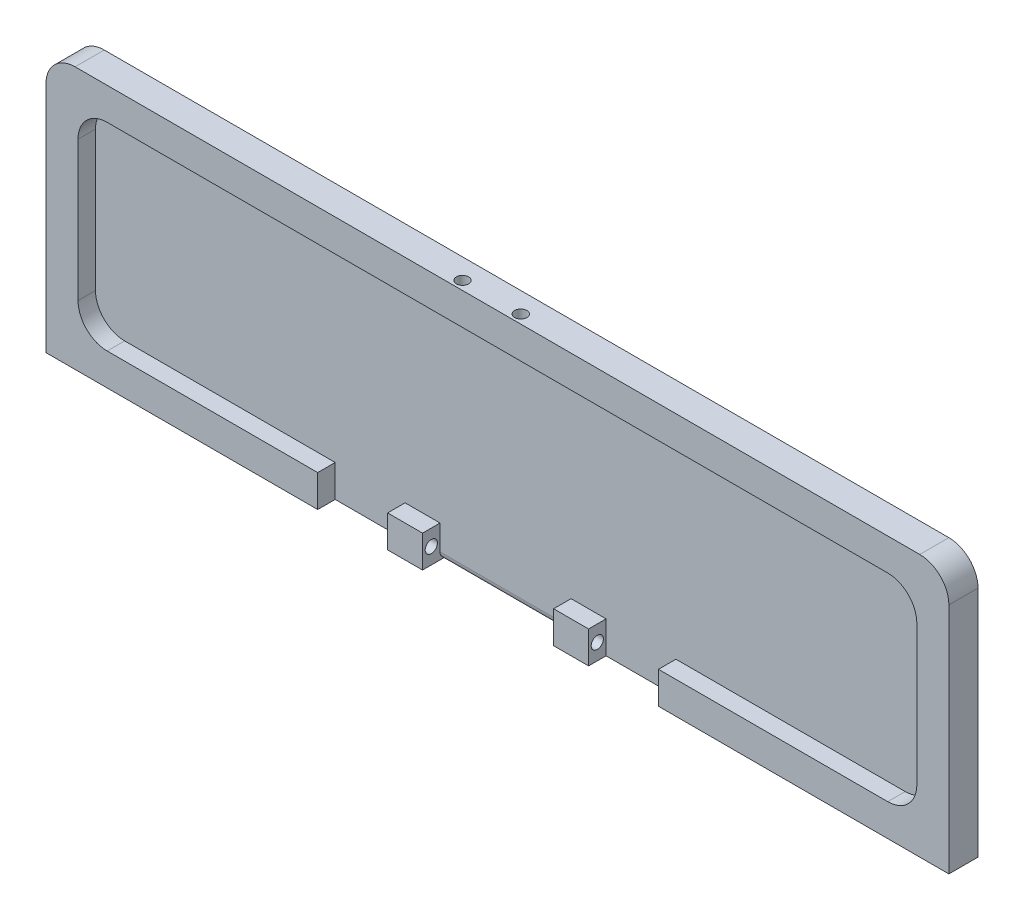
ISO-10303-21;
HEADER;
FILE_DESCRIPTION(('STEP AP214'),'2;1');
FILE_NAME('part.step','',(''),(''),'','','');
FILE_SCHEMA(('AUTOMOTIVE_DESIGN { 1 0 10303 214 1 1 1 1 }'));
ENDSEC;
DATA;
#1=APPLICATION_CONTEXT('core data for automotive mechanical design processes');
#2=APPLICATION_PROTOCOL_DEFINITION('international standard','automotive_design',2000,#1);
#3=PRODUCT_CONTEXT('',#1,'mechanical');
#4=PRODUCT('Part','Part','',(#3));
#5=PRODUCT_RELATED_PRODUCT_CATEGORY('part','',(#4));
#6=PRODUCT_DEFINITION_FORMATION('','',#4);
#7=PRODUCT_DEFINITION_CONTEXT('part definition',#1,'design');
#8=PRODUCT_DEFINITION('design','',#6,#7);
#9=PRODUCT_DEFINITION_SHAPE('','',#8);
#10=(LENGTH_UNIT() NAMED_UNIT(*) SI_UNIT(.MILLI.,.METRE.));
#11=(NAMED_UNIT(*) PLANE_ANGLE_UNIT() SI_UNIT($,.RADIAN.));
#12=(NAMED_UNIT(*) SI_UNIT($,.STERADIAN.) SOLID_ANGLE_UNIT());
#13=UNCERTAINTY_MEASURE_WITH_UNIT(LENGTH_MEASURE(1.E-05),#10,'distance_accuracy_value','');
#14=(GEOMETRIC_REPRESENTATION_CONTEXT(3) GLOBAL_UNCERTAINTY_ASSIGNED_CONTEXT((#13)) GLOBAL_UNIT_ASSIGNED_CONTEXT((#10,
#11,#12)) REPRESENTATION_CONTEXT('',''));
#15=CARTESIAN_POINT('',(0.,0.,0.));
#16=DIRECTION('',(0.,0.,1.));
#17=DIRECTION('',(1.,0.,0.));
#18=AXIS2_PLACEMENT_3D('',#15,#16,#17);
#19=CARTESIAN_POINT('',(0.,0.,5.));
#20=DIRECTION('',(0.,0.,1.));
#21=DIRECTION('',(1.,0.,0.));
#22=AXIS2_PLACEMENT_3D('',#19,#20,#21);
#23=PLANE('',#22);
#24=DIRECTION('',(0.,-1.,0.));
#25=VECTOR('',#24,1.);
#26=CARTESIAN_POINT('',(-30.8542724171356,-17.,5.));
#27=LINE('',#26,#25);
#28=CARTESIAN_POINT('',(-30.8542724171356,-17.,5.));
#29=VERTEX_POINT('',#28);
#30=CARTESIAN_POINT('',(-30.8542724171356,-22.5,5.));
#31=VERTEX_POINT('',#30);
#32=EDGE_CURVE('E233',#29,#31,#27,.T.);
#33=ORIENTED_EDGE('',*,*,#32,.F.);
#34=DIRECTION('',(1.,0.,0.));
#35=VECTOR('',#34,1.);
#36=CARTESIAN_POINT('',(72.,-17.,5.));
#37=LINE('',#36,#35);
#38=CARTESIAN_POINT('',(-67.,-17.,5.));
#39=VERTEX_POINT('',#38);
#40=EDGE_CURVE('E291',#39,#29,#37,.T.);
#41=ORIENTED_EDGE('',*,*,#40,.F.);
#42=CARTESIAN_POINT('',(-67.,-12.,5.));
#43=DIRECTION('',(0.,0.,1.));
#44=DIRECTION('',(1.,0.,0.));
#45=AXIS2_PLACEMENT_3D('',#42,#43,#44);
#46=CIRCLE('',#45,5.);
#47=CARTESIAN_POINT('',(-72.,-12.,5.));
#48=VERTEX_POINT('',#47);
#49=EDGE_CURVE('E461',#39,#48,#46,.F.);
#50=ORIENTED_EDGE('',*,*,#49,.T.);
#51=DIRECTION('',(0.,-1.,0.));
#52=VECTOR('',#51,1.);
#53=CARTESIAN_POINT('',(-72.,-17.,5.));
#54=LINE('',#53,#52);
#55=CARTESIAN_POINT('',(-72.,12.,5.));
#56=VERTEX_POINT('',#55);
#57=EDGE_CURVE('E296',#56,#48,#54,.T.);
#58=ORIENTED_EDGE('',*,*,#57,.F.);
#59=CARTESIAN_POINT('',(-67.,12.,5.));
#60=DIRECTION('',(0.,0.,1.));
#61=DIRECTION('',(1.,0.,0.));
#62=AXIS2_PLACEMENT_3D('',#59,#60,#61);
#63=CIRCLE('',#62,5.);
#64=CARTESIAN_POINT('',(-67.,17.,5.));
#65=VERTEX_POINT('',#64);
#66=EDGE_CURVE('E458',#56,#65,#63,.F.);
#67=ORIENTED_EDGE('',*,*,#66,.T.);
#68=DIRECTION('',(-1.,0.,0.));
#69=VECTOR('',#68,1.);
#70=CARTESIAN_POINT('',(72.,17.,5.));
#71=LINE('',#70,#69);
#72=CARTESIAN_POINT('',(67.,17.,5.));
#73=VERTEX_POINT('',#72);
#74=EDGE_CURVE('E282',#73,#65,#71,.T.);
#75=ORIENTED_EDGE('',*,*,#74,.F.);
#76=CARTESIAN_POINT('',(67.,12.,5.));
#77=DIRECTION('',(0.,0.,1.));
#78=DIRECTION('',(1.,0.,0.));
#79=AXIS2_PLACEMENT_3D('',#76,#77,#78);
#80=CIRCLE('',#79,5.);
#81=CARTESIAN_POINT('',(72.,12.,5.));
#82=VERTEX_POINT('',#81);
#83=EDGE_CURVE('E466',#73,#82,#80,.F.);
#84=ORIENTED_EDGE('',*,*,#83,.T.);
#85=DIRECTION('',(0.,1.,0.));
#86=VECTOR('',#85,1.);
#87=CARTESIAN_POINT('',(72.,-17.,5.));
#88=LINE('',#87,#86);
#89=CARTESIAN_POINT('',(72.,-12.,5.));
#90=VERTEX_POINT('',#89);
#91=EDGE_CURVE('E287',#90,#82,#88,.T.);
#92=ORIENTED_EDGE('',*,*,#91,.F.);
#93=CARTESIAN_POINT('',(67.,-12.,5.));
#94=DIRECTION('',(0.,0.,1.));
#95=DIRECTION('',(1.,0.,0.));
#96=AXIS2_PLACEMENT_3D('',#93,#94,#95);
#97=CIRCLE('',#96,5.);
#98=CARTESIAN_POINT('',(67.,-17.,5.));
#99=VERTEX_POINT('',#98);
#100=EDGE_CURVE('E463',#90,#99,#97,.F.);
#101=ORIENTED_EDGE('',*,*,#100,.T.);
#102=CARTESIAN_POINT('',(27.6457275828644,-17.,5.));
#103=VERTEX_POINT('',#102);
#104=EDGE_CURVE('E300',#103,#99,#37,.T.);
#105=ORIENTED_EDGE('',*,*,#104,.F.);
#106=DIRECTION('',(0.,1.,0.));
#107=VECTOR('',#106,1.);
#108=CARTESIAN_POINT('',(27.6457275828644,-17.,5.));
#109=LINE('',#108,#107);
#110=CARTESIAN_POINT('',(27.6457275828644,-22.5,5.));
#111=VERTEX_POINT('',#110);
#112=EDGE_CURVE('E364',#111,#103,#109,.T.);
#113=ORIENTED_EDGE('',*,*,#112,.F.);
#114=DIRECTION('',(1.,0.,0.));
#115=VECTOR('',#114,1.);
#116=CARTESIAN_POINT('',(77.5,-22.5,5.));
#117=LINE('',#116,#115);
#118=CARTESIAN_POINT('',(77.5,-22.5,5.));
#119=VERTEX_POINT('',#118);
#120=EDGE_CURVE('E252',#111,#119,#117,.T.);
#121=ORIENTED_EDGE('',*,*,#120,.T.);
#122=DIRECTION('',(0.,1.,0.));
#123=VECTOR('',#122,1.);
#124=CARTESIAN_POINT('',(77.5,-22.5,5.));
#125=LINE('',#124,#123);
#126=CARTESIAN_POINT('',(77.5,17.5,5.));
#127=VERTEX_POINT('',#126);
#128=EDGE_CURVE('E257',#119,#127,#125,.T.);
#129=ORIENTED_EDGE('',*,*,#128,.T.);
#130=CARTESIAN_POINT('',(72.5,17.5,5.));
#131=DIRECTION('',(0.,0.,1.));
#132=DIRECTION('',(1.,0.,0.));
#133=AXIS2_PLACEMENT_3D('',#130,#131,#132);
#134=CIRCLE('',#133,5.);
#135=CARTESIAN_POINT('',(72.5,22.5,5.));
#136=VERTEX_POINT('',#135);
#137=EDGE_CURVE('E592',#127,#136,#134,.T.);
#138=ORIENTED_EDGE('',*,*,#137,.T.);
#139=DIRECTION('',(-1.,0.,0.));
#140=VECTOR('',#139,1.);
#141=CARTESIAN_POINT('',(77.5,22.5,5.));
#142=LINE('',#141,#140);
#143=CARTESIAN_POINT('',(-72.5,22.5,5.));
#144=VERTEX_POINT('',#143);
#145=EDGE_CURVE('E619',#136,#144,#142,.T.);
#146=ORIENTED_EDGE('',*,*,#145,.T.);
#147=CARTESIAN_POINT('',(-72.5,17.5,5.));
#148=DIRECTION('',(0.,0.,1.));
#149=DIRECTION('',(1.,0.,0.));
#150=AXIS2_PLACEMENT_3D('',#147,#148,#149);
#151=CIRCLE('',#150,5.);
#152=CARTESIAN_POINT('',(-77.5,17.5,5.));
#153=VERTEX_POINT('',#152);
#154=EDGE_CURVE('E595',#144,#153,#151,.T.);
#155=ORIENTED_EDGE('',*,*,#154,.T.);
#156=DIRECTION('',(0.,-1.,0.));
#157=VECTOR('',#156,1.);
#158=CARTESIAN_POINT('',(-77.5,-22.5,5.));
#159=LINE('',#158,#157);
#160=CARTESIAN_POINT('',(-77.5,-22.5,5.));
#161=VERTEX_POINT('',#160);
#162=EDGE_CURVE('E263',#153,#161,#159,.T.);
#163=ORIENTED_EDGE('',*,*,#162,.T.);
#164=EDGE_CURVE('E249',#161,#31,#117,.T.);
#165=ORIENTED_EDGE('',*,*,#164,.T.);
#166=EDGE_LOOP('',(#33,#41,#50,#58,#67,#75,#84,#92,#101,#105,#113,#121,#129,#138,#146,#155,#163,#165));
#167=FACE_BOUND('',#166,.T.);
#168=ADVANCED_FACE('F43',(#167),#23,.T.);
#169=CARTESIAN_POINT('',(72.,-17.,2.));
#170=DIRECTION('',(0.,-1.,0.));
#171=DIRECTION('',(0.,0.,-1.));
#172=AXIS2_PLACEMENT_3D('',#169,#170,#171);
#173=PLANE('',#172);
#174=ORIENTED_EDGE('',*,*,#40,.T.);
#175=DIRECTION('',(0.,0.,1.));
#176=VECTOR('',#175,1.);
#177=CARTESIAN_POINT('',(-30.8542724171356,-17.,-11.2003787824441));
#178=LINE('',#177,#176);
#179=CARTESIAN_POINT('',(-30.8542724171356,-17.,2.));
#180=VERTEX_POINT('',#179);
#181=EDGE_CURVE('E401',#180,#29,#178,.T.);
#182=ORIENTED_EDGE('',*,*,#181,.F.);
#183=DIRECTION('',(1.,0.,0.));
#184=VECTOR('',#183,1.);
#185=CARTESIAN_POINT('',(72.,-17.,2.));
#186=LINE('',#185,#184);
#187=CARTESIAN_POINT('',(-67.,-17.,2.));
#188=VERTEX_POINT('',#187);
#189=EDGE_CURVE('E311',#188,#180,#186,.T.);
#190=ORIENTED_EDGE('',*,*,#189,.F.);
#191=DIRECTION('',(0.,0.,1.));
#192=VECTOR('',#191,1.);
#193=CARTESIAN_POINT('',(-67.,-17.,5.));
#194=LINE('',#193,#192);
#195=EDGE_CURVE('E448',#188,#39,#194,.T.);
#196=ORIENTED_EDGE('',*,*,#195,.T.);
#197=EDGE_LOOP('',(#174,#182,#190,#196));
#198=FACE_BOUND('',#197,.T.);
#199=ADVANCED_FACE('F422',(#198),#173,.F.);
#200=CARTESIAN_POINT('',(9.64572758286437,-17.,5.));
#201=VERTEX_POINT('',#200);
#202=CARTESIAN_POINT('',(15.6457275828644,-17.,5.));
#203=VERTEX_POINT('',#202);
#204=EDGE_CURVE('E295',#201,#203,#37,.T.);
#205=ORIENTED_EDGE('',*,*,#204,.T.);
#206=DIRECTION('',(0.,0.,1.));
#207=VECTOR('',#206,1.);
#208=CARTESIAN_POINT('',(15.6457275828644,-17.,2.));
#209=LINE('',#208,#207);
#210=CARTESIAN_POINT('',(15.6457275828644,-17.,2.));
#211=VERTEX_POINT('',#210);
#212=EDGE_CURVE('E355',#211,#203,#209,.T.);
#213=ORIENTED_EDGE('',*,*,#212,.F.);
#214=CARTESIAN_POINT('',(9.64572758286437,-17.,2.));
#215=VERTEX_POINT('',#214);
#216=EDGE_CURVE('E316',#215,#211,#186,.T.);
#217=ORIENTED_EDGE('',*,*,#216,.F.);
#218=DIRECTION('',(0.,0.,1.));
#219=VECTOR('',#218,1.);
#220=CARTESIAN_POINT('',(9.64572758286437,-17.,2.));
#221=LINE('',#220,#219);
#222=EDGE_CURVE('E301',#215,#201,#221,.T.);
#223=ORIENTED_EDGE('',*,*,#222,.T.);
#224=EDGE_LOOP('',(#205,#213,#217,#223));
#225=FACE_BOUND('',#224,.T.);
#226=ADVANCED_FACE('F508',(#225),#173,.F.);
#227=DIRECTION('',(0.,-1.,0.));
#228=VECTOR('',#227,1.);
#229=CARTESIAN_POINT('',(15.6457275828644,-22.5,5.));
#230=LINE('',#229,#228);
#231=CARTESIAN_POINT('',(15.6457275828644,-22.5,5.));
#232=VERTEX_POINT('',#231);
#233=EDGE_CURVE('E361',#203,#232,#230,.T.);
#234=ORIENTED_EDGE('',*,*,#233,.F.);
#235=ORIENTED_EDGE('',*,*,#204,.F.);
#236=DIRECTION('',(0.,1.,0.));
#237=VECTOR('',#236,1.);
#238=CARTESIAN_POINT('',(9.64572758286437,-17.,5.));
#239=LINE('',#238,#237);
#240=CARTESIAN_POINT('',(9.64572758286438,-22.5,5.));
#241=VERTEX_POINT('',#240);
#242=EDGE_CURVE('E334',#241,#201,#239,.T.);
#243=ORIENTED_EDGE('',*,*,#242,.F.);
#244=EDGE_CURVE('E250',#241,#232,#117,.T.);
#245=ORIENTED_EDGE('',*,*,#244,.T.);
#246=EDGE_LOOP('',(#234,#235,#243,#245));
#247=FACE_BOUND('',#246,.T.);
#248=ADVANCED_FACE('F504',(#247),#23,.T.);
#249=CARTESIAN_POINT('',(27.6457275828644,-17.,2.));
#250=VERTEX_POINT('',#249);
#251=CARTESIAN_POINT('',(67.,-17.,2.));
#252=VERTEX_POINT('',#251);
#253=EDGE_CURVE('E320',#250,#252,#186,.T.);
#254=ORIENTED_EDGE('',*,*,#253,.F.);
#255=DIRECTION('',(0.,0.,1.));
#256=VECTOR('',#255,1.);
#257=CARTESIAN_POINT('',(27.6457275828644,-17.,2.));
#258=LINE('',#257,#256);
#259=EDGE_CURVE('E350',#250,#103,#258,.T.);
#260=ORIENTED_EDGE('',*,*,#259,.T.);
#261=ORIENTED_EDGE('',*,*,#104,.T.);
#262=DIRECTION('',(0.,0.,1.));
#263=VECTOR('',#262,1.);
#264=CARTESIAN_POINT('',(67.,-17.,2.));
#265=LINE('',#264,#263);
#266=EDGE_CURVE('E438',#99,#252,#265,.F.);
#267=ORIENTED_EDGE('',*,*,#266,.T.);
#268=EDGE_LOOP('',(#254,#260,#261,#267));
#269=FACE_BOUND('',#268,.T.);
#270=ADVANCED_FACE('F514',(#269),#173,.F.);
#271=CARTESIAN_POINT('',(-77.5,-22.5,5.));
#272=DIRECTION('',(1.,0.,0.));
#273=DIRECTION('',(0.,0.,-1.));
#274=AXIS2_PLACEMENT_3D('',#271,#272,#273);
#275=PLANE('',#274);
#276=ORIENTED_EDGE('',*,*,#162,.F.);
#277=DIRECTION('',(0.,0.,-1.));
#278=VECTOR('',#277,1.);
#279=CARTESIAN_POINT('',(-77.5,17.5,5.));
#280=LINE('',#279,#278);
#281=CARTESIAN_POINT('',(-77.5,17.5,0.));
#282=VERTEX_POINT('',#281);
#283=EDGE_CURVE('E588',#153,#282,#280,.T.);
#284=ORIENTED_EDGE('',*,*,#283,.T.);
#285=DIRECTION('',(0.,-1.,0.));
#286=VECTOR('',#285,1.);
#287=CARTESIAN_POINT('',(-77.5,-22.5,0.));
#288=LINE('',#287,#286);
#289=CARTESIAN_POINT('',(-77.5,-22.5,0.));
#290=VERTEX_POINT('',#289);
#291=EDGE_CURVE('E306',#282,#290,#288,.T.);
#292=ORIENTED_EDGE('',*,*,#291,.T.);
#293=DIRECTION('',(0.,0.,-1.));
#294=VECTOR('',#293,1.);
#295=CARTESIAN_POINT('',(-77.5,-22.5,5.));
#296=LINE('',#295,#294);
#297=EDGE_CURVE('E613',#161,#290,#296,.T.);
#298=ORIENTED_EDGE('',*,*,#297,.F.);
#299=EDGE_LOOP('',(#276,#284,#292,#298));
#300=FACE_BOUND('',#299,.T.);
#301=ADVANCED_FACE('F538',(#300),#275,.F.);
#302=CARTESIAN_POINT('',(77.5,-22.5,5.));
#303=DIRECTION('',(0.,1.,0.));
#304=DIRECTION('',(-1.,0.,0.));
#305=AXIS2_PLACEMENT_3D('',#302,#303,#304);
#306=PLANE('',#305);
#307=DIRECTION('',(-1.,0.,0.));
#308=VECTOR('',#307,1.);
#309=CARTESIAN_POINT('',(-30.8542724171356,-22.5,2.));
#310=LINE('',#309,#308);
#311=CARTESIAN_POINT('',(-18.8542724171356,-22.5,2.));
#312=VERTEX_POINT('',#311);
#313=CARTESIAN_POINT('',(-30.8542724171356,-22.5,2.));
#314=VERTEX_POINT('',#313);
#315=EDGE_CURVE('E397',#312,#314,#310,.T.);
#316=ORIENTED_EDGE('',*,*,#315,.T.);
#317=DIRECTION('',(0.,0.,1.));
#318=VECTOR('',#317,1.);
#319=CARTESIAN_POINT('',(-30.8542724171356,-22.5,-11.2003787824441));
#320=LINE('',#319,#318);
#321=EDGE_CURVE('E404',#314,#31,#320,.T.);
#322=ORIENTED_EDGE('',*,*,#321,.T.);
#323=ORIENTED_EDGE('',*,*,#164,.F.);
#324=ORIENTED_EDGE('',*,*,#297,.T.);
#325=DIRECTION('',(1.,0.,0.));
#326=VECTOR('',#325,1.);
#327=CARTESIAN_POINT('',(77.5,-22.5,0.));
#328=LINE('',#327,#326);
#329=CARTESIAN_POINT('',(77.5,-22.5,0.));
#330=VERTEX_POINT('',#329);
#331=EDGE_CURVE('E624',#290,#330,#328,.T.);
#332=ORIENTED_EDGE('',*,*,#331,.T.);
#333=DIRECTION('',(0.,0.,-1.));
#334=VECTOR('',#333,1.);
#335=CARTESIAN_POINT('',(77.5,-22.5,5.));
#336=LINE('',#335,#334);
#337=EDGE_CURVE('E616',#119,#330,#336,.T.);
#338=ORIENTED_EDGE('',*,*,#337,.F.);
#339=ORIENTED_EDGE('',*,*,#120,.F.);
#340=DIRECTION('',(0.,0.,1.));
#341=VECTOR('',#340,1.);
#342=CARTESIAN_POINT('',(27.6457275828644,-22.5,2.));
#343=LINE('',#342,#341);
#344=CARTESIAN_POINT('',(27.6457275828644,-22.5,2.));
#345=VERTEX_POINT('',#344);
#346=EDGE_CURVE('E347',#345,#111,#343,.T.);
#347=ORIENTED_EDGE('',*,*,#346,.F.);
#348=DIRECTION('',(1.,0.,0.));
#349=VECTOR('',#348,1.);
#350=CARTESIAN_POINT('',(27.6457275828644,-22.5,2.));
#351=LINE('',#350,#349);
#352=CARTESIAN_POINT('',(15.6457275828644,-22.5,2.));
#353=VERTEX_POINT('',#352);
#354=EDGE_CURVE('E363',#353,#345,#351,.T.);
#355=ORIENTED_EDGE('',*,*,#354,.F.);
#356=DIRECTION('',(0.,0.,1.));
#357=VECTOR('',#356,1.);
#358=CARTESIAN_POINT('',(15.6457275828644,-22.5,2.));
#359=LINE('',#358,#357);
#360=EDGE_CURVE('E341',#353,#232,#359,.T.);
#361=ORIENTED_EDGE('',*,*,#360,.T.);
#362=ORIENTED_EDGE('',*,*,#244,.F.);
#363=DIRECTION('',(0.,0.,1.));
#364=VECTOR('',#363,1.);
#365=CARTESIAN_POINT('',(9.64572758286438,-22.5,2.));
#366=LINE('',#365,#364);
#367=CARTESIAN_POINT('',(9.64572758286438,-22.5,0.8));
#368=VERTEX_POINT('',#367);
#369=EDGE_CURVE('E328',#368,#241,#366,.T.);
#370=ORIENTED_EDGE('',*,*,#369,.F.);
#371=DIRECTION('',(1.,0.,0.));
#372=VECTOR('',#371,1.);
#373=CARTESIAN_POINT('',(-12.8542724171356,-22.5,0.8));
#374=LINE('',#373,#372);
#375=CARTESIAN_POINT('',(-12.8542724171356,-22.5,0.8));
#376=VERTEX_POINT('',#375);
#377=EDGE_CURVE('E472',#368,#376,#374,.F.);
#378=ORIENTED_EDGE('',*,*,#377,.T.);
#379=DIRECTION('',(0.,0.,1.));
#380=VECTOR('',#379,1.);
#381=CARTESIAN_POINT('',(-12.8542724171356,-22.5,2.));
#382=LINE('',#381,#380);
#383=CARTESIAN_POINT('',(-12.8542724171356,-22.5,5.));
#384=VERTEX_POINT('',#383);
#385=EDGE_CURVE('E247',#376,#384,#382,.T.);
#386=ORIENTED_EDGE('',*,*,#385,.T.);
#387=CARTESIAN_POINT('',(-18.8542724171356,-22.5,5.));
#388=VERTEX_POINT('',#387);
#389=EDGE_CURVE('E239',#388,#384,#117,.T.);
#390=ORIENTED_EDGE('',*,*,#389,.F.);
#391=DIRECTION('',(0.,0.,1.));
#392=VECTOR('',#391,1.);
#393=CARTESIAN_POINT('',(-18.8542724171356,-22.5,-11.2003787824441));
#394=LINE('',#393,#392);
#395=EDGE_CURVE('E222',#312,#388,#394,.T.);
#396=ORIENTED_EDGE('',*,*,#395,.F.);
#397=EDGE_LOOP('',(#316,#322,#323,#324,#332,#338,#339,#347,#355,#361,#362,#370,#378,#386,#390,#396));
#398=FACE_BOUND('',#397,.T.);
#399=ADVANCED_FACE('F245',(#398),#306,.F.);
#400=CARTESIAN_POINT('',(77.5,-22.5,5.));
#401=DIRECTION('',(-1.,0.,0.));
#402=DIRECTION('',(0.,0.,1.));
#403=AXIS2_PLACEMENT_3D('',#400,#401,#402);
#404=PLANE('',#403);
#405=DIRECTION('',(0.,1.,0.));
#406=VECTOR('',#405,1.);
#407=CARTESIAN_POINT('',(77.5,-22.5,0.));
#408=LINE('',#407,#406);
#409=CARTESIAN_POINT('',(77.5,17.5,0.));
#410=VERTEX_POINT('',#409);
#411=EDGE_CURVE('E279',#330,#410,#408,.T.);
#412=ORIENTED_EDGE('',*,*,#411,.T.);
#413=DIRECTION('',(0.,0.,-1.));
#414=VECTOR('',#413,1.);
#415=CARTESIAN_POINT('',(77.5,17.5,5.));
#416=LINE('',#415,#414);
#417=EDGE_CURVE('E597',#410,#127,#416,.F.);
#418=ORIENTED_EDGE('',*,*,#417,.T.);
#419=ORIENTED_EDGE('',*,*,#128,.F.);
#420=ORIENTED_EDGE('',*,*,#337,.T.);
#421=EDGE_LOOP('',(#412,#418,#419,#420));
#422=FACE_BOUND('',#421,.T.);
#423=ADVANCED_FACE('F525',(#422),#404,.F.);
#424=CARTESIAN_POINT('',(77.5,22.5,5.));
#425=DIRECTION('',(0.,-1.,0.));
#426=DIRECTION('',(1.,0.,0.));
#427=AXIS2_PLACEMENT_3D('',#424,#425,#426);
#428=PLANE('',#427);
#429=CARTESIAN_POINT('',(2.5,22.5,3.5));
#430=DIRECTION('',(0.,1.,0.));
#431=DIRECTION('',(0.,0.,1.));
#432=AXIS2_PLACEMENT_3D('',#429,#430,#431);
#433=CIRCLE('',#432,1.04999999999999);
#434=CARTESIAN_POINT('',(2.5,22.5,4.54999999999999));
#435=VERTEX_POINT('',#434);
#436=EDGE_CURVE('E392',#435,#435,#433,.T.);
#437=ORIENTED_EDGE('',*,*,#436,.F.);
#438=EDGE_LOOP('',(#437));
#439=FACE_BOUND('',#438,.T.);
#440=CARTESIAN_POINT('',(-7.5,22.5,3.5));
#441=DIRECTION('',(0.,1.,0.));
#442=DIRECTION('',(0.,0.,1.));
#443=AXIS2_PLACEMENT_3D('',#440,#441,#442);
#444=CIRCLE('',#443,1.04999999999999);
#445=CARTESIAN_POINT('',(-7.5,22.5,4.54999999999999));
#446=VERTEX_POINT('',#445);
#447=EDGE_CURVE('E384',#446,#446,#444,.T.);
#448=ORIENTED_EDGE('',*,*,#447,.F.);
#449=EDGE_LOOP('',(#448));
#450=FACE_BOUND('',#449,.T.);
#451=ORIENTED_EDGE('',*,*,#145,.F.);
#452=DIRECTION('',(0.,0.,-1.));
#453=VECTOR('',#452,1.);
#454=CARTESIAN_POINT('',(72.5,22.5,5.));
#455=LINE('',#454,#453);
#456=CARTESIAN_POINT('',(72.5,22.5,0.));
#457=VERTEX_POINT('',#456);
#458=EDGE_CURVE('E606',#136,#457,#455,.T.);
#459=ORIENTED_EDGE('',*,*,#458,.T.);
#460=DIRECTION('',(-1.,0.,0.));
#461=VECTOR('',#460,1.);
#462=CARTESIAN_POINT('',(77.5,22.5,0.));
#463=LINE('',#462,#461);
#464=CARTESIAN_POINT('',(-72.5,22.5,0.));
#465=VERTEX_POINT('',#464);
#466=EDGE_CURVE('E272',#457,#465,#463,.T.);
#467=ORIENTED_EDGE('',*,*,#466,.T.);
#468=DIRECTION('',(0.,0.,-1.));
#469=VECTOR('',#468,1.);
#470=CARTESIAN_POINT('',(-72.5,22.5,5.));
#471=LINE('',#470,#469);
#472=EDGE_CURVE('E610',#465,#144,#471,.F.);
#473=ORIENTED_EDGE('',*,*,#472,.T.);
#474=EDGE_LOOP('',(#451,#459,#467,#473));
#475=FACE_BOUND('',#474,.T.);
#476=ADVANCED_FACE('F518',(#439,#450,#475),#428,.F.);
#477=DIRECTION('',(0.,1.,0.));
#478=VECTOR('',#477,1.);
#479=CARTESIAN_POINT('',(-18.8542724171356,-22.5,5.));
#480=LINE('',#479,#478);
#481=CARTESIAN_POINT('',(-18.8542724171356,-17.,5.));
#482=VERTEX_POINT('',#481);
#483=EDGE_CURVE('E226',#388,#482,#480,.T.);
#484=ORIENTED_EDGE('',*,*,#483,.F.);
#485=ORIENTED_EDGE('',*,*,#389,.T.);
#486=DIRECTION('',(0.,-1.,0.));
#487=VECTOR('',#486,1.);
#488=CARTESIAN_POINT('',(-12.8542724171356,-22.5,5.));
#489=LINE('',#488,#487);
#490=CARTESIAN_POINT('',(-12.8542724171356,-17.,5.));
#491=VERTEX_POINT('',#490);
#492=EDGE_CURVE('E338',#491,#384,#489,.T.);
#493=ORIENTED_EDGE('',*,*,#492,.F.);
#494=EDGE_CURVE('E241',#482,#491,#37,.T.);
#495=ORIENTED_EDGE('',*,*,#494,.F.);
#496=EDGE_LOOP('',(#484,#485,#493,#495));
#497=FACE_BOUND('',#496,.T.);
#498=ADVANCED_FACE('F237',(#497),#23,.T.);
#499=CARTESIAN_POINT('',(0.,0.,0.));
#500=DIRECTION('',(0.,0.,1.));
#501=DIRECTION('',(1.,0.,0.));
#502=AXIS2_PLACEMENT_3D('',#499,#500,#501);
#503=PLANE('',#502);
#504=ORIENTED_EDGE('',*,*,#466,.F.);
#505=CARTESIAN_POINT('',(72.5,17.5,0.));
#506=DIRECTION('',(0.,0.,1.));
#507=DIRECTION('',(1.,0.,0.));
#508=AXIS2_PLACEMENT_3D('',#505,#506,#507);
#509=CIRCLE('',#508,5.);
#510=EDGE_CURVE('E600',#457,#410,#509,.F.);
#511=ORIENTED_EDGE('',*,*,#510,.T.);
#512=ORIENTED_EDGE('',*,*,#411,.F.);
#513=ORIENTED_EDGE('',*,*,#331,.F.);
#514=ORIENTED_EDGE('',*,*,#291,.F.);
#515=CARTESIAN_POINT('',(-72.5,17.5,0.));
#516=DIRECTION('',(0.,0.,1.));
#517=DIRECTION('',(1.,0.,0.));
#518=AXIS2_PLACEMENT_3D('',#515,#516,#517);
#519=CIRCLE('',#518,5.);
#520=EDGE_CURVE('E603',#282,#465,#519,.F.);
#521=ORIENTED_EDGE('',*,*,#520,.T.);
#522=EDGE_LOOP('',(#504,#511,#512,#513,#514,#521));
#523=FACE_BOUND('',#522,.T.);
#524=ADVANCED_FACE('F517',(#523),#503,.F.);
#525=CARTESIAN_POINT('',(-72.,-17.,2.));
#526=DIRECTION('',(-1.,0.,0.));
#527=DIRECTION('',(0.,0.,1.));
#528=AXIS2_PLACEMENT_3D('',#525,#526,#527);
#529=PLANE('',#528);
#530=DIRECTION('',(0.,-1.,0.));
#531=VECTOR('',#530,1.);
#532=CARTESIAN_POINT('',(-72.,-17.,2.));
#533=LINE('',#532,#531);
#534=CARTESIAN_POINT('',(-72.,12.,2.));
#535=VERTEX_POINT('',#534);
#536=CARTESIAN_POINT('',(-72.,-12.,2.));
#537=VERTEX_POINT('',#536);
#538=EDGE_CURVE('E286',#535,#537,#533,.T.);
#539=ORIENTED_EDGE('',*,*,#538,.F.);
#540=DIRECTION('',(0.,0.,1.));
#541=VECTOR('',#540,1.);
#542=CARTESIAN_POINT('',(-72.,12.,5.));
#543=LINE('',#542,#541);
#544=EDGE_CURVE('E582',#535,#56,#543,.T.);
#545=ORIENTED_EDGE('',*,*,#544,.T.);
#546=ORIENTED_EDGE('',*,*,#57,.T.);
#547=DIRECTION('',(0.,0.,1.));
#548=VECTOR('',#547,1.);
#549=CARTESIAN_POINT('',(-72.,-12.,2.));
#550=LINE('',#549,#548);
#551=EDGE_CURVE('E585',#48,#537,#550,.F.);
#552=ORIENTED_EDGE('',*,*,#551,.T.);
#553=EDGE_LOOP('',(#539,#545,#546,#552));
#554=FACE_BOUND('',#553,.T.);
#555=ADVANCED_FACE('F523',(#554),#529,.F.);
#556=CARTESIAN_POINT('',(72.,17.,2.));
#557=DIRECTION('',(0.,1.,0.));
#558=DIRECTION('',(0.,0.,1.));
#559=AXIS2_PLACEMENT_3D('',#556,#557,#558);
#560=PLANE('',#559);
#561=CARTESIAN_POINT('',(2.5,17.,3.5));
#562=DIRECTION('',(0.,1.,0.));
#563=DIRECTION('',(0.,0.,1.));
#564=AXIS2_PLACEMENT_3D('',#561,#562,#563);
#565=CIRCLE('',#564,1.04999999999999);
#566=CARTESIAN_POINT('',(2.5,17.,4.54999999999999));
#567=VERTEX_POINT('',#566);
#568=EDGE_CURVE('E388',#567,#567,#565,.T.);
#569=ORIENTED_EDGE('',*,*,#568,.T.);
#570=EDGE_LOOP('',(#569));
#571=FACE_BOUND('',#570,.T.);
#572=CARTESIAN_POINT('',(-7.5,17.,3.5));
#573=DIRECTION('',(0.,1.,0.));
#574=DIRECTION('',(0.,0.,1.));
#575=AXIS2_PLACEMENT_3D('',#572,#573,#574);
#576=CIRCLE('',#575,1.04999999999999);
#577=CARTESIAN_POINT('',(-7.5,17.,4.54999999999999));
#578=VERTEX_POINT('',#577);
#579=EDGE_CURVE('E383',#578,#578,#576,.T.);
#580=ORIENTED_EDGE('',*,*,#579,.T.);
#581=EDGE_LOOP('',(#580));
#582=FACE_BOUND('',#581,.T.);
#583=ORIENTED_EDGE('',*,*,#74,.T.);
#584=DIRECTION('',(0.,0.,1.));
#585=VECTOR('',#584,1.);
#586=CARTESIAN_POINT('',(-67.,17.,2.));
#587=LINE('',#586,#585);
#588=CARTESIAN_POINT('',(-67.,17.,2.));
#589=VERTEX_POINT('',#588);
#590=EDGE_CURVE('E576',#65,#589,#587,.F.);
#591=ORIENTED_EDGE('',*,*,#590,.T.);
#592=DIRECTION('',(-1.,0.,0.));
#593=VECTOR('',#592,1.);
#594=CARTESIAN_POINT('',(72.,17.,2.));
#595=LINE('',#594,#593);
#596=CARTESIAN_POINT('',(67.,17.,2.));
#597=VERTEX_POINT('',#596);
#598=EDGE_CURVE('E302',#597,#589,#595,.T.);
#599=ORIENTED_EDGE('',*,*,#598,.F.);
#600=DIRECTION('',(0.,0.,1.));
#601=VECTOR('',#600,1.);
#602=CARTESIAN_POINT('',(67.,17.,5.));
#603=LINE('',#602,#601);
#604=EDGE_CURVE('E574',#597,#73,#603,.T.);
#605=ORIENTED_EDGE('',*,*,#604,.T.);
#606=EDGE_LOOP('',(#583,#591,#599,#605));
#607=FACE_BOUND('',#606,.T.);
#608=ADVANCED_FACE('F484',(#571,#582,#607),#560,.F.);
#609=CARTESIAN_POINT('',(72.,-17.,2.));
#610=DIRECTION('',(1.,0.,0.));
#611=DIRECTION('',(0.,0.,-1.));
#612=AXIS2_PLACEMENT_3D('',#609,#610,#611);
#613=PLANE('',#612);
#614=DIRECTION('',(0.,1.,0.));
#615=VECTOR('',#614,1.);
#616=CARTESIAN_POINT('',(72.,-17.,2.));
#617=LINE('',#616,#615);
#618=CARTESIAN_POINT('',(72.,-12.,2.));
#619=VERTEX_POINT('',#618);
#620=CARTESIAN_POINT('',(72.,12.,2.));
#621=VERTEX_POINT('',#620);
#622=EDGE_CURVE('E307',#619,#621,#617,.T.);
#623=ORIENTED_EDGE('',*,*,#622,.F.);
#624=DIRECTION('',(0.,0.,1.));
#625=VECTOR('',#624,1.);
#626=CARTESIAN_POINT('',(72.,-12.,5.));
#627=LINE('',#626,#625);
#628=EDGE_CURVE('E454',#619,#90,#627,.T.);
#629=ORIENTED_EDGE('',*,*,#628,.T.);
#630=ORIENTED_EDGE('',*,*,#91,.T.);
#631=DIRECTION('',(0.,0.,1.));
#632=VECTOR('',#631,1.);
#633=CARTESIAN_POINT('',(72.,12.,2.));
#634=LINE('',#633,#632);
#635=EDGE_CURVE('E451',#82,#621,#634,.F.);
#636=ORIENTED_EDGE('',*,*,#635,.T.);
#637=EDGE_LOOP('',(#623,#629,#630,#636));
#638=FACE_BOUND('',#637,.T.);
#639=ADVANCED_FACE('F653',(#638),#613,.F.);
#640=CARTESIAN_POINT('',(-18.8542724171356,-17.,2.));
#641=VERTEX_POINT('',#640);
#642=CARTESIAN_POINT('',(-12.8542724171356,-17.,2.));
#643=VERTEX_POINT('',#642);
#644=EDGE_CURVE('E315',#641,#643,#186,.T.);
#645=ORIENTED_EDGE('',*,*,#644,.F.);
#646=DIRECTION('',(0.,0.,1.));
#647=VECTOR('',#646,1.);
#648=CARTESIAN_POINT('',(-18.8542724171356,-17.,-11.2003787824441));
#649=LINE('',#648,#647);
#650=EDGE_CURVE('E232',#641,#482,#649,.T.);
#651=ORIENTED_EDGE('',*,*,#650,.T.);
#652=ORIENTED_EDGE('',*,*,#494,.T.);
#653=DIRECTION('',(0.,0.,1.));
#654=VECTOR('',#653,1.);
#655=CARTESIAN_POINT('',(-12.8542724171356,-17.,2.));
#656=LINE('',#655,#654);
#657=EDGE_CURVE('E321',#643,#491,#656,.T.);
#658=ORIENTED_EDGE('',*,*,#657,.F.);
#659=EDGE_LOOP('',(#645,#651,#652,#658));
#660=FACE_BOUND('',#659,.T.);
#661=ADVANCED_FACE('F510',(#660),#173,.F.);
#662=CARTESIAN_POINT('',(0.,0.,2.));
#663=DIRECTION('',(0.,0.,1.));
#664=DIRECTION('',(1.,0.,0.));
#665=AXIS2_PLACEMENT_3D('',#662,#663,#664);
#666=PLANE('',#665);
#667=DIRECTION('',(0.,-1.,0.));
#668=VECTOR('',#667,1.);
#669=CARTESIAN_POINT('',(-12.8542724171356,-22.5,2.));
#670=LINE('',#669,#668);
#671=CARTESIAN_POINT('',(-12.8542724171356,-21.3,2.));
#672=VERTEX_POINT('',#671);
#673=EDGE_CURVE('E337',#643,#672,#670,.T.);
#674=ORIENTED_EDGE('',*,*,#673,.T.);
#675=DIRECTION('',(1.,0.,0.));
#676=VECTOR('',#675,1.);
#677=CARTESIAN_POINT('',(9.64572758286438,-21.3,2.));
#678=LINE('',#677,#676);
#679=CARTESIAN_POINT('',(9.64572758286438,-21.3,2.));
#680=VERTEX_POINT('',#679);
#681=EDGE_CURVE('E469',#672,#680,#678,.T.);
#682=ORIENTED_EDGE('',*,*,#681,.T.);
#683=DIRECTION('',(0.,1.,0.));
#684=VECTOR('',#683,1.);
#685=CARTESIAN_POINT('',(9.64572758286437,-17.,2.));
#686=LINE('',#685,#684);
#687=EDGE_CURVE('E325',#680,#215,#686,.T.);
#688=ORIENTED_EDGE('',*,*,#687,.T.);
#689=ORIENTED_EDGE('',*,*,#216,.T.);
#690=DIRECTION('',(0.,-1.,0.));
#691=VECTOR('',#690,1.);
#692=CARTESIAN_POINT('',(15.6457275828644,-22.5,2.));
#693=LINE('',#692,#691);
#694=EDGE_CURVE('E351',#211,#353,#693,.T.);
#695=ORIENTED_EDGE('',*,*,#694,.T.);
#696=ORIENTED_EDGE('',*,*,#354,.T.);
#697=DIRECTION('',(0.,1.,0.));
#698=VECTOR('',#697,1.);
#699=CARTESIAN_POINT('',(27.6457275828644,-17.,2.));
#700=LINE('',#699,#698);
#701=EDGE_CURVE('E68',#345,#250,#700,.T.);
#702=ORIENTED_EDGE('',*,*,#701,.T.);
#703=ORIENTED_EDGE('',*,*,#253,.T.);
#704=CARTESIAN_POINT('',(67.,-12.,2.));
#705=DIRECTION('',(0.,0.,1.));
#706=DIRECTION('',(1.,0.,0.));
#707=AXIS2_PLACEMENT_3D('',#704,#705,#706);
#708=CIRCLE('',#707,5.);
#709=EDGE_CURVE('E434',#252,#619,#708,.T.);
#710=ORIENTED_EDGE('',*,*,#709,.T.);
#711=ORIENTED_EDGE('',*,*,#622,.T.);
#712=CARTESIAN_POINT('',(67.,12.,2.));
#713=DIRECTION('',(0.,0.,1.));
#714=DIRECTION('',(1.,0.,0.));
#715=AXIS2_PLACEMENT_3D('',#712,#713,#714);
#716=CIRCLE('',#715,5.);
#717=EDGE_CURVE('E441',#621,#597,#716,.T.);
#718=ORIENTED_EDGE('',*,*,#717,.T.);
#719=ORIENTED_EDGE('',*,*,#598,.T.);
#720=CARTESIAN_POINT('',(-67.,12.,2.));
#721=DIRECTION('',(0.,0.,1.));
#722=DIRECTION('',(1.,0.,0.));
#723=AXIS2_PLACEMENT_3D('',#720,#721,#722);
#724=CIRCLE('',#723,5.);
#725=EDGE_CURVE('E433',#589,#535,#724,.T.);
#726=ORIENTED_EDGE('',*,*,#725,.T.);
#727=ORIENTED_EDGE('',*,*,#538,.T.);
#728=CARTESIAN_POINT('',(-67.,-12.,2.));
#729=DIRECTION('',(0.,0.,1.));
#730=DIRECTION('',(1.,0.,0.));
#731=AXIS2_PLACEMENT_3D('',#728,#729,#730);
#732=CIRCLE('',#731,5.);
#733=EDGE_CURVE('E428',#537,#188,#732,.T.);
#734=ORIENTED_EDGE('',*,*,#733,.T.);
#735=ORIENTED_EDGE('',*,*,#189,.T.);
#736=DIRECTION('',(0.,1.,0.));
#737=VECTOR('',#736,1.);
#738=CARTESIAN_POINT('',(-30.8542724171356,-17.,2.));
#739=LINE('',#738,#737);
#740=EDGE_CURVE('E407',#314,#180,#739,.T.);
#741=ORIENTED_EDGE('',*,*,#740,.F.);
#742=ORIENTED_EDGE('',*,*,#315,.F.);
#743=DIRECTION('',(0.,-1.,0.));
#744=VECTOR('',#743,1.);
#745=CARTESIAN_POINT('',(-18.8542724171356,-22.5,2.));
#746=LINE('',#745,#744);
#747=EDGE_CURVE('E61',#641,#312,#746,.T.);
#748=ORIENTED_EDGE('',*,*,#747,.F.);
#749=ORIENTED_EDGE('',*,*,#644,.T.);
#750=EDGE_LOOP('',(#674,#682,#688,#689,#695,#696,#702,#703,#710,#711,#718,#719,#726,#727,#734,
#735,#741,#742,#748,#749));
#751=FACE_BOUND('',#750,.T.);
#752=ADVANCED_FACE('F426',(#751),#666,.T.);
#753=CARTESIAN_POINT('',(72.5,17.5,5.));
#754=DIRECTION('',(0.,0.,-1.));
#755=DIRECTION('',(-1.,0.,0.));
#756=AXIS2_PLACEMENT_3D('',#753,#754,#755);
#757=CYLINDRICAL_SURFACE('',#756,5.);
#758=ORIENTED_EDGE('',*,*,#137,.F.);
#759=ORIENTED_EDGE('',*,*,#417,.F.);
#760=ORIENTED_EDGE('',*,*,#510,.F.);
#761=ORIENTED_EDGE('',*,*,#458,.F.);
#762=EDGE_LOOP('',(#758,#759,#760,#761));
#763=FACE_BOUND('',#762,.T.);
#764=ADVANCED_FACE('F542',(#763),#757,.T.);
#765=CARTESIAN_POINT('',(-72.5,17.5,5.));
#766=DIRECTION('',(0.,0.,-1.));
#767=DIRECTION('',(-1.,0.,0.));
#768=AXIS2_PLACEMENT_3D('',#765,#766,#767);
#769=CYLINDRICAL_SURFACE('',#768,5.);
#770=ORIENTED_EDGE('',*,*,#154,.F.);
#771=ORIENTED_EDGE('',*,*,#472,.F.);
#772=ORIENTED_EDGE('',*,*,#520,.F.);
#773=ORIENTED_EDGE('',*,*,#283,.F.);
#774=EDGE_LOOP('',(#770,#771,#772,#773));
#775=FACE_BOUND('',#774,.T.);
#776=ADVANCED_FACE('F545',(#775),#769,.T.);
#777=CARTESIAN_POINT('',(-67.,12.,2.));
#778=DIRECTION('',(0.,0.,-1.));
#779=DIRECTION('',(-1.,0.,0.));
#780=AXIS2_PLACEMENT_3D('',#777,#778,#779);
#781=CYLINDRICAL_SURFACE('',#780,5.);
#782=ORIENTED_EDGE('',*,*,#725,.F.);
#783=ORIENTED_EDGE('',*,*,#590,.F.);
#784=ORIENTED_EDGE('',*,*,#66,.F.);
#785=ORIENTED_EDGE('',*,*,#544,.F.);
#786=EDGE_LOOP('',(#782,#783,#784,#785));
#787=FACE_BOUND('',#786,.T.);
#788=ADVANCED_FACE('F549',(#787),#781,.F.);
#789=CARTESIAN_POINT('',(-67.,-12.,2.));
#790=DIRECTION('',(0.,0.,-1.));
#791=DIRECTION('',(-1.,0.,0.));
#792=AXIS2_PLACEMENT_3D('',#789,#790,#791);
#793=CYLINDRICAL_SURFACE('',#792,5.);
#794=ORIENTED_EDGE('',*,*,#733,.F.);
#795=ORIENTED_EDGE('',*,*,#551,.F.);
#796=ORIENTED_EDGE('',*,*,#49,.F.);
#797=ORIENTED_EDGE('',*,*,#195,.F.);
#798=EDGE_LOOP('',(#794,#795,#796,#797));
#799=FACE_BOUND('',#798,.T.);
#800=ADVANCED_FACE('F553',(#799),#793,.F.);
#801=CARTESIAN_POINT('',(67.,-12.,2.));
#802=DIRECTION('',(0.,0.,-1.));
#803=DIRECTION('',(-1.,0.,0.));
#804=AXIS2_PLACEMENT_3D('',#801,#802,#803);
#805=CYLINDRICAL_SURFACE('',#804,5.);
#806=ORIENTED_EDGE('',*,*,#709,.F.);
#807=ORIENTED_EDGE('',*,*,#266,.F.);
#808=ORIENTED_EDGE('',*,*,#100,.F.);
#809=ORIENTED_EDGE('',*,*,#628,.F.);
#810=EDGE_LOOP('',(#806,#807,#808,#809));
#811=FACE_BOUND('',#810,.T.);
#812=ADVANCED_FACE('F557',(#811),#805,.F.);
#813=CARTESIAN_POINT('',(67.,12.,2.));
#814=DIRECTION('',(0.,0.,-1.));
#815=DIRECTION('',(-1.,0.,0.));
#816=AXIS2_PLACEMENT_3D('',#813,#814,#815);
#817=CYLINDRICAL_SURFACE('',#816,5.);
#818=ORIENTED_EDGE('',*,*,#717,.F.);
#819=ORIENTED_EDGE('',*,*,#635,.F.);
#820=ORIENTED_EDGE('',*,*,#83,.F.);
#821=ORIENTED_EDGE('',*,*,#604,.F.);
#822=EDGE_LOOP('',(#818,#819,#820,#821));
#823=FACE_BOUND('',#822,.T.);
#824=ADVANCED_FACE('F559',(#823),#817,.F.);
#825=CARTESIAN_POINT('',(9.64572758286437,-17.,2.));
#826=DIRECTION('',(1.,0.,0.));
#827=DIRECTION('',(0.,1.,0.));
#828=AXIS2_PLACEMENT_3D('',#825,#826,#827);
#829=PLANE('',#828);
#830=CARTESIAN_POINT('',(9.64572758286437,-19.75,3.5));
#831=DIRECTION('',(1.,0.,0.));
#832=DIRECTION('',(0.,1.,0.));
#833=AXIS2_PLACEMENT_3D('',#830,#831,#832);
#834=CIRCLE('',#833,1.05);
#835=CARTESIAN_POINT('',(9.64572758286437,-18.7,3.5));
#836=VERTEX_POINT('',#835);
#837=EDGE_CURVE('E367',#836,#836,#834,.T.);
#838=ORIENTED_EDGE('',*,*,#837,.T.);
#839=EDGE_LOOP('',(#838));
#840=FACE_BOUND('',#839,.T.);
#841=ORIENTED_EDGE('',*,*,#242,.T.);
#842=ORIENTED_EDGE('',*,*,#222,.F.);
#843=ORIENTED_EDGE('',*,*,#687,.F.);
#844=CARTESIAN_POINT('',(9.64572758286438,-21.3,0.8));
#845=DIRECTION('',(1.,0.,0.));
#846=DIRECTION('',(0.,1.,0.));
#847=AXIS2_PLACEMENT_3D('',#844,#845,#846);
#848=CIRCLE('',#847,1.2);
#849=EDGE_CURVE('E53',#680,#368,#848,.T.);
#850=ORIENTED_EDGE('',*,*,#849,.T.);
#851=ORIENTED_EDGE('',*,*,#369,.T.);
#852=EDGE_LOOP('',(#841,#842,#843,#850,#851));
#853=FACE_BOUND('',#852,.T.);
#854=ADVANCED_FACE('F562',(#840,#853),#829,.F.);
#855=CARTESIAN_POINT('',(-12.8542724171356,-22.5,2.));
#856=DIRECTION('',(-1.,0.,0.));
#857=DIRECTION('',(0.,0.,1.));
#858=AXIS2_PLACEMENT_3D('',#855,#856,#857);
#859=PLANE('',#858);
#860=CARTESIAN_POINT('',(-12.8542724171356,-19.75,3.5));
#861=DIRECTION('',(-1.,0.,0.));
#862=DIRECTION('',(0.,0.,1.));
#863=AXIS2_PLACEMENT_3D('',#860,#861,#862);
#864=CIRCLE('',#863,1.05);
#865=CARTESIAN_POINT('',(-12.8542724171356,-19.75,4.55));
#866=VERTEX_POINT('',#865);
#867=EDGE_CURVE('E378',#866,#866,#864,.T.);
#868=ORIENTED_EDGE('',*,*,#867,.T.);
#869=EDGE_LOOP('',(#868));
#870=FACE_BOUND('',#869,.T.);
#871=ORIENTED_EDGE('',*,*,#492,.T.);
#872=ORIENTED_EDGE('',*,*,#385,.F.);
#873=CARTESIAN_POINT('',(-12.8542724171356,-21.3,0.8));
#874=DIRECTION('',(-1.,0.,0.));
#875=DIRECTION('',(0.,0.,1.));
#876=AXIS2_PLACEMENT_3D('',#873,#874,#875);
#877=CIRCLE('',#876,1.2);
#878=EDGE_CURVE('E11',#376,#672,#877,.T.);
#879=ORIENTED_EDGE('',*,*,#878,.T.);
#880=ORIENTED_EDGE('',*,*,#673,.F.);
#881=ORIENTED_EDGE('',*,*,#657,.T.);
#882=EDGE_LOOP('',(#871,#872,#879,#880,#881));
#883=FACE_BOUND('',#882,.T.);
#884=ADVANCED_FACE('F567',(#870,#883),#859,.F.);
#885=CARTESIAN_POINT('',(0.,-21.3,0.8));
#886=DIRECTION('',(-1.,0.,0.));
#887=DIRECTION('',(0.,-1.,0.));
#888=AXIS2_PLACEMENT_3D('',#885,#886,#887);
#889=CYLINDRICAL_SURFACE('',#888,1.2);
#890=ORIENTED_EDGE('',*,*,#878,.F.);
#891=ORIENTED_EDGE('',*,*,#377,.F.);
#892=ORIENTED_EDGE('',*,*,#849,.F.);
#893=ORIENTED_EDGE('',*,*,#681,.F.);
#894=EDGE_LOOP('',(#890,#891,#892,#893));
#895=FACE_BOUND('',#894,.T.);
#896=ADVANCED_FACE('F45',(#895),#889,.T.);
#897=CARTESIAN_POINT('',(15.6457275828644,-22.5,2.));
#898=DIRECTION('',(-1.,0.,0.));
#899=DIRECTION('',(0.,0.,1.));
#900=AXIS2_PLACEMENT_3D('',#897,#898,#899);
#901=PLANE('',#900);
#902=CARTESIAN_POINT('',(15.6457275828644,-19.75,3.5));
#903=DIRECTION('',(1.,0.,0.));
#904=DIRECTION('',(0.,0.,-1.));
#905=AXIS2_PLACEMENT_3D('',#902,#903,#904);
#906=CIRCLE('',#905,1.05);
#907=CARTESIAN_POINT('',(15.6457275828644,-19.75,2.45));
#908=VERTEX_POINT('',#907);
#909=EDGE_CURVE('E379',#908,#908,#906,.T.);
#910=ORIENTED_EDGE('',*,*,#909,.F.);
#911=EDGE_LOOP('',(#910));
#912=FACE_BOUND('',#911,.T.);
#913=ORIENTED_EDGE('',*,*,#233,.T.);
#914=ORIENTED_EDGE('',*,*,#360,.F.);
#915=ORIENTED_EDGE('',*,*,#694,.F.);
#916=ORIENTED_EDGE('',*,*,#212,.T.);
#917=EDGE_LOOP('',(#913,#914,#915,#916));
#918=FACE_BOUND('',#917,.T.);
#919=ADVANCED_FACE('F715',(#912,#918),#901,.F.);
#920=CARTESIAN_POINT('',(27.6457275828644,-17.,2.));
#921=DIRECTION('',(1.,0.,0.));
#922=DIRECTION('',(0.,0.,-1.));
#923=AXIS2_PLACEMENT_3D('',#920,#921,#922);
#924=PLANE('',#923);
#925=ORIENTED_EDGE('',*,*,#112,.T.);
#926=ORIENTED_EDGE('',*,*,#259,.F.);
#927=ORIENTED_EDGE('',*,*,#701,.F.);
#928=ORIENTED_EDGE('',*,*,#346,.T.);
#929=EDGE_LOOP('',(#925,#926,#927,#928));
#930=FACE_BOUND('',#929,.T.);
#931=ADVANCED_FACE('F713',(#930),#924,.F.);
#932=CARTESIAN_POINT('',(15.6457275828644,-19.75,3.5));
#933=DIRECTION('',(1.,0.,0.));
#934=DIRECTION('',(0.,0.,-1.));
#935=AXIS2_PLACEMENT_3D('',#932,#933,#934);
#936=CYLINDRICAL_SURFACE('',#935,1.05);
#937=CARTESIAN_POINT('',(-18.8542724171356,-19.75,3.5));
#938=DIRECTION('',(1.,0.,0.));
#939=DIRECTION('',(0.,0.,-1.));
#940=AXIS2_PLACEMENT_3D('',#937,#938,#939);
#941=CIRCLE('',#940,1.05);
#942=CARTESIAN_POINT('',(-18.8542724171356,-19.75,2.45));
#943=VERTEX_POINT('',#942);
#944=EDGE_CURVE('E47',#943,#943,#941,.F.);
#945=ORIENTED_EDGE('',*,*,#944,.T.);
#946=EDGE_LOOP('',(#945));
#947=FACE_BOUND('',#946,.T.);
#948=ORIENTED_EDGE('',*,*,#867,.F.);
#949=EDGE_LOOP('',(#948));
#950=FACE_BOUND('',#949,.T.);
#951=ADVANCED_FACE('F499',(#947,#950),#936,.F.);
#952=ORIENTED_EDGE('',*,*,#909,.T.);
#953=EDGE_LOOP('',(#952));
#954=FACE_BOUND('',#953,.T.);
#955=ORIENTED_EDGE('',*,*,#837,.F.);
#956=EDGE_LOOP('',(#955));
#957=FACE_BOUND('',#956,.T.);
#958=ADVANCED_FACE('F490',(#954,#957),#936,.F.);
#959=CARTESIAN_POINT('',(-7.5,22.5,3.5));
#960=DIRECTION('',(0.,1.,0.));
#961=DIRECTION('',(0.,0.,1.));
#962=AXIS2_PLACEMENT_3D('',#959,#960,#961);
#963=CYLINDRICAL_SURFACE('',#962,1.04999999999999);
#964=ORIENTED_EDGE('',*,*,#447,.T.);
#965=EDGE_LOOP('',(#964));
#966=FACE_BOUND('',#965,.T.);
#967=ORIENTED_EDGE('',*,*,#579,.F.);
#968=EDGE_LOOP('',(#967));
#969=FACE_BOUND('',#968,.T.);
#970=ADVANCED_FACE('F487',(#966,#969),#963,.F.);
#971=CARTESIAN_POINT('',(2.5,22.5,3.5));
#972=DIRECTION('',(0.,1.,0.));
#973=DIRECTION('',(0.,0.,1.));
#974=AXIS2_PLACEMENT_3D('',#971,#972,#973);
#975=CYLINDRICAL_SURFACE('',#974,1.04999999999999);
#976=ORIENTED_EDGE('',*,*,#436,.T.);
#977=EDGE_LOOP('',(#976));
#978=FACE_BOUND('',#977,.T.);
#979=ORIENTED_EDGE('',*,*,#568,.F.);
#980=EDGE_LOOP('',(#979));
#981=FACE_BOUND('',#980,.T.);
#982=ADVANCED_FACE('F489',(#978,#981),#975,.F.);
#983=CARTESIAN_POINT('',(-18.8542724171356,-22.5,-11.2003787824441));
#984=DIRECTION('',(1.,0.,0.));
#985=DIRECTION('',(0.,0.,-1.));
#986=AXIS2_PLACEMENT_3D('',#983,#984,#985);
#987=PLANE('',#986);
#988=ORIENTED_EDGE('',*,*,#747,.T.);
#989=ORIENTED_EDGE('',*,*,#395,.T.);
#990=ORIENTED_EDGE('',*,*,#483,.T.);
#991=ORIENTED_EDGE('',*,*,#650,.F.);
#992=EDGE_LOOP('',(#988,#989,#990,#991));
#993=FACE_BOUND('',#992,.T.);
#994=ORIENTED_EDGE('',*,*,#944,.F.);
#995=EDGE_LOOP('',(#994));
#996=FACE_BOUND('',#995,.T.);
#997=ADVANCED_FACE('F224',(#993,#996),#987,.F.);
#998=CARTESIAN_POINT('',(-30.8542724171356,-17.,-11.2003787824441));
#999=DIRECTION('',(-1.,0.,0.));
#1000=DIRECTION('',(0.,-1.,0.));
#1001=AXIS2_PLACEMENT_3D('',#998,#999,#1000);
#1002=PLANE('',#1001);
#1003=ORIENTED_EDGE('',*,*,#740,.T.);
#1004=ORIENTED_EDGE('',*,*,#181,.T.);
#1005=ORIENTED_EDGE('',*,*,#32,.T.);
#1006=ORIENTED_EDGE('',*,*,#321,.F.);
#1007=EDGE_LOOP('',(#1003,#1004,#1005,#1006));
#1008=FACE_BOUND('',#1007,.T.);
#1009=ADVANCED_FACE('F418',(#1008),#1002,.F.);
#1010=CLOSED_SHELL('',(#168,#199,#226,#248,#270,#301,#399,#423,#476,#498,#524,#555,#608,#639,
#661,#752,#764,#776,#788,#800,#812,#824,#854,#884,#896,#919,#931,#951,#958,#970,#982,#997,#1009));
#1011=MANIFOLD_SOLID_BREP('B2',#1010);
#1012=ADVANCED_BREP_SHAPE_REPRESENTATION('',(#18,#1011),#14);
#1013=SHAPE_DEFINITION_REPRESENTATION(#9,#1012);
ENDSEC;
END-ISO-10303-21;
